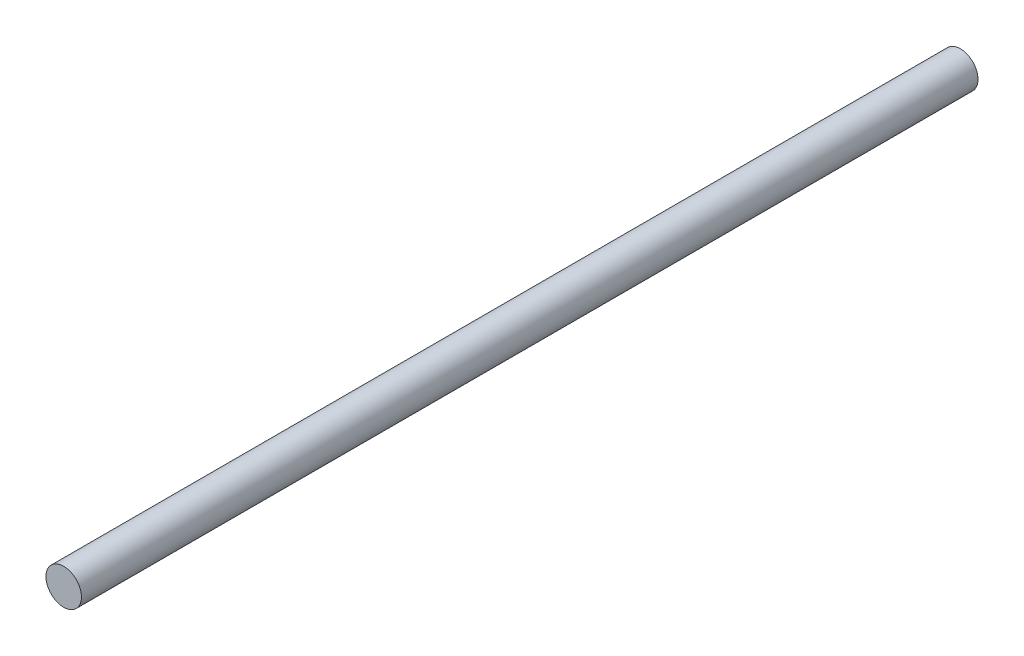
ISO-10303-21;
HEADER;
FILE_DESCRIPTION(('STEP AP214'),'2;1');
FILE_NAME('part.step','',(''),(''),'','','');
FILE_SCHEMA(('AUTOMOTIVE_DESIGN { 1 0 10303 214 1 1 1 1 }'));
ENDSEC;
DATA;
#1=APPLICATION_CONTEXT('core data for automotive mechanical design processes');
#2=APPLICATION_PROTOCOL_DEFINITION('international standard','automotive_design',2000,#1);
#3=PRODUCT_CONTEXT('',#1,'mechanical');
#4=PRODUCT('Part','Part','',(#3));
#5=PRODUCT_RELATED_PRODUCT_CATEGORY('part','',(#4));
#6=PRODUCT_DEFINITION_FORMATION('','',#4);
#7=PRODUCT_DEFINITION_CONTEXT('part definition',#1,'design');
#8=PRODUCT_DEFINITION('design','',#6,#7);
#9=PRODUCT_DEFINITION_SHAPE('','',#8);
#10=(LENGTH_UNIT() NAMED_UNIT(*) SI_UNIT(.MILLI.,.METRE.));
#11=(NAMED_UNIT(*) PLANE_ANGLE_UNIT() SI_UNIT($,.RADIAN.));
#12=(NAMED_UNIT(*) SI_UNIT($,.STERADIAN.) SOLID_ANGLE_UNIT());
#13=UNCERTAINTY_MEASURE_WITH_UNIT(LENGTH_MEASURE(1.E-05),#10,'distance_accuracy_value','');
#14=(GEOMETRIC_REPRESENTATION_CONTEXT(3) GLOBAL_UNCERTAINTY_ASSIGNED_CONTEXT((#13)) GLOBAL_UNIT_ASSIGNED_CONTEXT((#10,
#11,#12)) REPRESENTATION_CONTEXT('',''));
#15=CARTESIAN_POINT('',(0.,0.,0.));
#16=DIRECTION('',(0.,0.,1.));
#17=DIRECTION('',(1.,0.,0.));
#18=AXIS2_PLACEMENT_3D('',#15,#16,#17);
#19=CARTESIAN_POINT('',(0.,0.,120.));
#20=DIRECTION('',(0.,0.,-1.));
#21=DIRECTION('',(-1.,0.,0.));
#22=AXIS2_PLACEMENT_3D('',#19,#20,#21);
#23=CYLINDRICAL_SURFACE('',#22,2.375);
#24=CARTESIAN_POINT('',(0.,0.,120.));
#25=DIRECTION('',(0.,0.,1.));
#26=DIRECTION('',(1.,0.,0.));
#27=AXIS2_PLACEMENT_3D('',#24,#25,#26);
#28=CIRCLE('',#27,2.375);
#29=CARTESIAN_POINT('',(2.375,0.,120.));
#30=VERTEX_POINT('',#29);
#31=EDGE_CURVE('E10',#30,#30,#28,.T.);
#32=ORIENTED_EDGE('',*,*,#31,.F.);
#33=EDGE_LOOP('',(#32));
#34=FACE_BOUND('',#33,.T.);
#35=CARTESIAN_POINT('',(0.,0.,0.));
#36=DIRECTION('',(0.,0.,1.));
#37=DIRECTION('',(1.,0.,0.));
#38=AXIS2_PLACEMENT_3D('',#35,#36,#37);
#39=CIRCLE('',#38,2.375);
#40=CARTESIAN_POINT('',(2.375,0.,0.));
#41=VERTEX_POINT('',#40);
#42=EDGE_CURVE('E36',#41,#41,#39,.T.);
#43=ORIENTED_EDGE('',*,*,#42,.T.);
#44=EDGE_LOOP('',(#43));
#45=FACE_BOUND('',#44,.T.);
#46=ADVANCED_FACE('F33',(#34,#45),#23,.T.);
#47=CARTESIAN_POINT('',(0.,0.,120.));
#48=DIRECTION('',(0.,0.,1.));
#49=DIRECTION('',(1.,0.,0.));
#50=AXIS2_PLACEMENT_3D('',#47,#48,#49);
#51=PLANE('',#50);
#52=ORIENTED_EDGE('',*,*,#31,.T.);
#53=EDGE_LOOP('',(#52));
#54=FACE_BOUND('',#53,.T.);
#55=ADVANCED_FACE('F48',(#54),#51,.T.);
#56=CARTESIAN_POINT('',(0.,0.,0.));
#57=DIRECTION('',(0.,0.,1.));
#58=DIRECTION('',(1.,0.,0.));
#59=AXIS2_PLACEMENT_3D('',#56,#57,#58);
#60=PLANE('',#59);
#61=ORIENTED_EDGE('',*,*,#42,.F.);
#62=EDGE_LOOP('',(#61));
#63=FACE_BOUND('',#62,.T.);
#64=ADVANCED_FACE('F46',(#63),#60,.F.);
#65=CLOSED_SHELL('',(#46,#55,#64));
#66=MANIFOLD_SOLID_BREP('B2',#65);
#67=ADVANCED_BREP_SHAPE_REPRESENTATION('',(#18,#66),#14);
#68=SHAPE_DEFINITION_REPRESENTATION(#9,#67);
ENDSEC;
END-ISO-10303-21;
